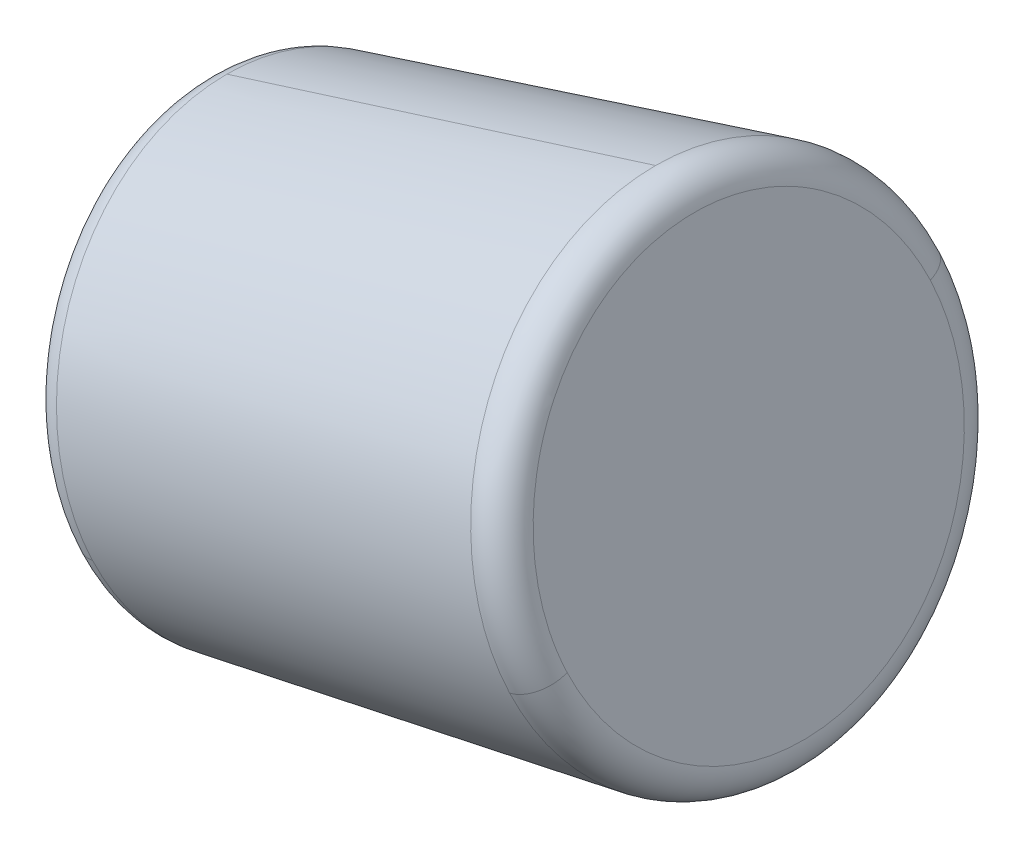
ISO-10303-21;
HEADER;
FILE_DESCRIPTION(('STEP AP214'),'2;1');
FILE_NAME('part.step','',(''),(''),'','','');
FILE_SCHEMA(('AUTOMOTIVE_DESIGN { 1 0 10303 214 1 1 1 1 }'));
ENDSEC;
DATA;
#1=APPLICATION_CONTEXT('core data for automotive mechanical design processes');
#2=APPLICATION_PROTOCOL_DEFINITION('international standard','automotive_design',2000,#1);
#3=PRODUCT_CONTEXT('',#1,'mechanical');
#4=PRODUCT('Part','Part','',(#3));
#5=PRODUCT_RELATED_PRODUCT_CATEGORY('part','',(#4));
#6=PRODUCT_DEFINITION_FORMATION('','',#4);
#7=PRODUCT_DEFINITION_CONTEXT('part definition',#1,'design');
#8=PRODUCT_DEFINITION('design','',#6,#7);
#9=PRODUCT_DEFINITION_SHAPE('','',#8);
#10=(LENGTH_UNIT() NAMED_UNIT(*) SI_UNIT(.MILLI.,.METRE.));
#11=(NAMED_UNIT(*) PLANE_ANGLE_UNIT() SI_UNIT($,.RADIAN.));
#12=(NAMED_UNIT(*) SI_UNIT($,.STERADIAN.) SOLID_ANGLE_UNIT());
#13=UNCERTAINTY_MEASURE_WITH_UNIT(LENGTH_MEASURE(1.E-05),#10,'distance_accuracy_value','');
#14=(GEOMETRIC_REPRESENTATION_CONTEXT(3) GLOBAL_UNCERTAINTY_ASSIGNED_CONTEXT((#13)) GLOBAL_UNIT_ASSIGNED_CONTEXT((#10,
#11,#12)) REPRESENTATION_CONTEXT('',''));
#15=CARTESIAN_POINT('',(0.,0.,0.));
#16=DIRECTION('',(0.,0.,1.));
#17=DIRECTION('',(1.,0.,0.));
#18=AXIS2_PLACEMENT_3D('',#15,#16,#17);
#19=CARTESIAN_POINT('',(32.1924799049898,40.0755787886419,0.));
#20=DIRECTION('',(0.965431699015822,0.260656161514406,0.));
#21=DIRECTION('',(-0.260656161514406,0.965431699015822,0.));
#22=AXIS2_PLACEMENT_3D('',#19,#20,#21);
#23=PLANE('',#22);
#24=CARTESIAN_POINT('',(32.6416984406534,38.4117400687143,5.30412357710646));
#25=CARTESIAN_POINT('',(32.6643205816638,38.3279510191703,5.27592609037514));
#26=CARTESIAN_POINT('',(32.6867619715337,38.2448314449983,5.24559492734474));
#27=CARTESIAN_POINT('',(32.7312299737908,38.080128570831,5.18074627308536));
#28=CARTESIAN_POINT('',(32.7532565861779,37.9985452708357,5.14622878185638));
#29=CARTESIAN_POINT('',(32.7968417582674,37.837112268455,5.07308849559944));
#30=CARTESIAN_POINT('',(32.8184003179699,37.7572625660694,5.03446570057148));
#31=CARTESIAN_POINT('',(32.8609975048126,37.5994889142674,4.95320842348219));
#32=CARTESIAN_POINT('',(32.8820361319528,37.5215649648509,4.91057394142086));
#33=CARTESIAN_POINT('',(32.9235427546146,37.36783060076,4.82139584744887));
#34=CARTESIAN_POINT('',(32.9440107501362,37.2920201860855,4.77485223553821));
#35=CARTESIAN_POINT('',(32.9843268044291,37.1426955103615,4.67796805050633));
#36=CARTESIAN_POINT('',(33.0041748632004,37.0691812493119,4.6276274773851));
#37=CARTESIAN_POINT('',(33.0432032271921,36.9246259871633,4.52327063379589));
#38=CARTESIAN_POINT('',(33.0623835324126,36.8535849860642,4.4692543633279));
#39=CARTESIAN_POINT('',(33.100030182559,36.7141473867304,4.35767625791571));
#40=CARTESIAN_POINT('',(33.118496527485,36.6457507884957,4.3001144229715));
#41=CARTESIAN_POINT('',(33.154670769922,36.511766768576,4.18158385932032));
#42=CARTESIAN_POINT('',(33.172378667433,36.446179346891,4.12061513061334));
#43=CARTESIAN_POINT('',(33.2069933551848,36.3179716858369,3.99541765865564));
#44=CARTESIAN_POINT('',(33.2239001454256,36.2553514464677,3.93118891540492));
#45=CARTESIAN_POINT('',(33.2568718886928,36.1332290077075,3.79962614697136));
#46=CARTESIAN_POINT('',(33.2729368417193,36.0737268083165,3.73229212178852));
#47=CARTESIAN_POINT('',(33.3041862086803,35.9579837955171,3.59468100307035));
#48=CARTESIAN_POINT('',(33.319370622615,35.9017429821088,3.52440390953501));
#49=CARTESIAN_POINT('',(33.3488223308088,35.7926582303219,3.38107595778163));
#50=CARTESIAN_POINT('',(33.3630896250681,35.7398142919433,3.30802509956359));
#51=CARTESIAN_POINT('',(33.3906727227498,35.6376505958917,3.15932560436185));
#52=CARTESIAN_POINT('',(33.4039885261722,35.5883308382186,3.08367696737815));
#53=CARTESIAN_POINT('',(33.4296365632434,35.4933343191943,2.92996415883732));
#54=CARTESIAN_POINT('',(33.4419687968923,35.447657557843,2.85189998728019));
#55=CARTESIAN_POINT('',(33.4656199849853,35.360057070781,2.69354417301949));
#56=CARTESIAN_POINT('',(33.4769389394294,35.3181333450704,2.61325253031592));
#57=CARTESIAN_POINT('',(33.4985363007605,35.238139927217,2.45063520336229));
#58=CARTESIAN_POINT('',(33.5088147076473,35.2000702350743,2.36830951911223));
#59=CARTESIAN_POINT('',(33.5283062122812,35.1278765975798,2.20182243884988));
#60=CARTESIAN_POINT('',(33.5375193100283,35.0937526522279,2.11766104283758));
#61=CARTESIAN_POINT('',(33.5548580012232,35.0295327158883,1.94770529122541));
#62=CARTESIAN_POINT('',(33.562983594671,34.9994367249006,1.86191093562554));
#63=CARTESIAN_POINT('',(33.578127702001,34.9433452011676,1.68889595095555));
#64=CARTESIAN_POINT('',(33.5851462158833,34.9173496684223,1.60167532188544));
#65=CARTESIAN_POINT('',(33.5980592558675,34.8695216866896,1.42601791241003));
#66=CARTESIAN_POINT('',(33.6039537819695,34.8476892377022,1.33758113200473));
#67=CARTESIAN_POINT('',(33.6146046459635,34.808240019767,1.15970447180909));
#68=CARTESIAN_POINT('',(33.6193609838555,34.7906232508193,1.07026459201875));
#69=CARTESIAN_POINT('',(33.6277240129951,34.759647833303,0.890597201557448));
#70=CARTESIAN_POINT('',(33.6313307042426,34.7462891847345,0.800369690886488));
#71=CARTESIAN_POINT('',(33.6373857512579,34.723862190131,0.619344404640153));
#72=CARTESIAN_POINT('',(33.6398341070257,34.7147938440961,0.528546629064777));
#73=CARTESIAN_POINT('',(33.6435665847783,34.7009693009998,0.346599552803916));
#74=CARTESIAN_POINT('',(33.644850706763,34.6962131039384,0.25545025211843));
#75=CARTESIAN_POINT('',(33.6462516233869,34.6910243168845,0.0730197122864389));
#76=CARTESIAN_POINT('',(33.6463684180261,34.690591726892,-0.0182615268600669));
#77=CARTESIAN_POINT('',(33.6454343985905,34.694051196123,-0.200736039113706));
#78=CARTESIAN_POINT('',(33.6443835845157,34.6979432553465,-0.291929312220839));
#79=CARTESIAN_POINT('',(33.6411168791552,34.710042646698,-0.474008199813227));
#80=CARTESIAN_POINT('',(33.6389009878695,34.7182499788259,-0.564893814298483));
#81=CARTESIAN_POINT('',(33.6333094663636,34.7389601438043,-0.746138433241184));
#82=CARTESIAN_POINT('',(33.6299338361432,34.7514629766548,-0.836497437698629));
#83=CARTESIAN_POINT('',(33.6220309689568,34.7807340226587,-1.01647115382945));
#84=CARTESIAN_POINT('',(33.6175037319907,34.7975022358122,-1.10608586550283));
#85=CARTESIAN_POINT('',(33.6073085578231,34.835263646328,-1.28435510637579));
#86=CARTESIAN_POINT('',(33.6016406206215,34.8562568436903,-1.37300963557536));
#87=CARTESIAN_POINT('',(33.5891777005403,34.9024176481725,-1.54914493497465));
#88=CARTESIAN_POINT('',(33.5823827176606,34.9275852552924,-1.63662570517435));
#89=CARTESIAN_POINT('',(33.5676820759318,34.9820342483198,-1.81020273773608));
#90=CARTESIAN_POINT('',(33.5597764170827,35.0113156342273,-1.8962990000981));
#91=CARTESIAN_POINT('',(33.54287346884,35.0739216434065,-2.06689960354727));
#92=CARTESIAN_POINT('',(33.5338761794462,35.1072462666783,-2.15140394463443));
#93=CARTESIAN_POINT('',(33.5148116453723,35.1778584686496,-2.31861712717449));
#94=CARTESIAN_POINT('',(33.5047444006921,35.2151460473491,-2.4013259686274));
#95=CARTESIAN_POINT('',(33.4835642089195,35.2935943311331,-2.56474889905548));
#96=CARTESIAN_POINT('',(33.4724512618271,35.3347550362174,-2.64546298803064));
#97=CARTESIAN_POINT('',(33.4492064372929,35.4208504130271,-2.80470196619317));
#98=CARTESIAN_POINT('',(33.4370745598512,35.4657850847524,-2.88322685538053));
#99=CARTESIAN_POINT('',(33.4118211013738,35.5593201432841,-3.03789826063142));
#100=CARTESIAN_POINT('',(33.3986995203381,35.6079205300904,-3.11404477669495));
#101=CARTESIAN_POINT('',(33.3714982657108,35.7086699361952,-3.26377599207135));
#102=CARTESIAN_POINT('',(33.3574185921193,35.7608189554938,-3.33736069138421));
#103=CARTESIAN_POINT('',(33.3283350715471,35.8685399950279,-3.48179100127336));
#104=CARTESIAN_POINT('',(33.3133312245666,35.9241120152636,-3.55263661184965));
#105=CARTESIAN_POINT('',(33.282435502798,36.0385451788076,-3.69141807098443));
#106=CARTESIAN_POINT('',(33.26654362801,36.097406322116,-3.75935391954293));
#107=CARTESIAN_POINT('',(33.2339101355449,36.2182759301557,-3.89215219123247));
#108=CARTESIAN_POINT('',(33.2171685178679,36.280284394887,-3.95701461436352));
#109=CARTESIAN_POINT('',(33.182875871648,36.4072992619497,-4.08350977593956));
#110=CARTESIAN_POINT('',(33.1653248431051,36.4723056642811,-4.14514251438456));
#111=CARTESIAN_POINT('',(33.1294556571188,36.6051598004268,-4.2650298279232));
#112=CARTESIAN_POINT('',(33.1111374996754,36.6730075342412,-4.32328440301684));
#113=CARTESIAN_POINT('',(33.0737781859335,36.8113808822194,-4.43627504947888));
#114=CARTESIAN_POINT('',(33.0547370296351,36.8819064963833,-4.49101112084727));
#115=CARTESIAN_POINT('',(33.0159775899967,37.0254657026785,-4.59683289586856));
#116=CARTESIAN_POINT('',(32.9962593066567,37.09849929481,-4.64791859952146));
#117=CARTESIAN_POINT('',(32.9561931160068,37.2468985127201,-4.74631656917708));
#118=CARTESIAN_POINT('',(32.935845208697,37.3222641384987,-4.79362883517981));
#119=CARTESIAN_POINT('',(32.8945687899983,37.4751458613095,-4.88436595014223));
#120=CARTESIAN_POINT('',(32.8736402786095,37.5526619583416,-4.92779079910192));
#121=CARTESIAN_POINT('',(32.83125307037,37.7096578805918,-5.01064846571356));
#122=CARTESIAN_POINT('',(32.8097943735193,37.78913770581,-5.05008128336549));
#123=CARTESIAN_POINT('',(32.7663984902364,37.9498696105719,-5.12485989025001));
#124=CARTESIAN_POINT('',(32.7444613038042,38.0311216901155,-5.16020567948259));
#125=CARTESIAN_POINT('',(32.7001612899616,38.195202360152,-5.22672507842611));
#126=CARTESIAN_POINT('',(32.6777984625514,38.2780309506447,-5.25789868813706));
#127=CARTESIAN_POINT('',(32.6327010407628,38.4450651012499,-5.31599862808135));
#128=CARTESIAN_POINT('',(32.6099664463845,38.5292706613623,-5.34292495831469));
#129=CARTESIAN_POINT('',(32.5641802602891,38.6988558926368,-5.39246547141464));
#130=CARTESIAN_POINT('',(32.541128668572,38.7842355637988,-5.41507965428125));
#131=CARTESIAN_POINT('',(32.4947640211023,38.9559633300672,-5.45594139310464));
#132=CARTESIAN_POINT('',(32.4714509653497,39.0423114251736,-5.47418894906142));
#133=CARTESIAN_POINT('',(32.4246195530032,39.2157680192026,-5.50627347408889));
#134=CARTESIAN_POINT('',(32.4011011964094,39.302876518125,-5.52011044315957));
#135=CARTESIAN_POINT('',(32.3539158401575,39.4776440677976,-5.54334046000286));
#136=CARTESIAN_POINT('',(32.3302488404994,39.5653031185478,-5.55273350777546));
#137=CARTESIAN_POINT('',(32.2828232140095,39.7409605934872,-5.56705305312954));
#138=CARTESIAN_POINT('',(32.2590645871777,39.8289590176765,-5.57197955071102));
#139=CARTESIAN_POINT('',(32.2115129428959,40.0050832437961,-5.57735412813305));
#140=CARTESIAN_POINT('',(32.1877199254458,40.0932090457264,-5.57780220797359));
#141=CARTESIAN_POINT('',(32.1401568196055,40.2693757237557,-5.57421886741092));
#142=CARTESIAN_POINT('',(32.1163867312153,40.3574165998547,-5.57018744700771));
#143=CARTESIAN_POINT('',(32.0689267469171,40.533201331012,-5.55765482934497));
#144=CARTESIAN_POINT('',(32.045236851009,40.6209451860703,-5.54915363208544));
#145=CARTESIAN_POINT('',(31.9979943257047,40.7959244814201,-5.52770189850779));
#146=CARTESIAN_POINT('',(31.9744416963084,40.8831599217115,-5.51475136218966));
#147=CARTESIAN_POINT('',(31.9275304331962,41.0569122711141,-5.48443230745298));
#148=CARTESIAN_POINT('',(31.9041717994803,41.1434291802252,-5.46706378903442));
#149=CARTESIAN_POINT('',(31.8577048424421,41.3155358859363,-5.42795002278275));
#150=CARTESIAN_POINT('',(31.8345965191197,41.4011256825362,-5.40620477494963));
#151=CARTESIAN_POINT('',(31.788685697148,41.5711725465805,-5.3583921364789));
#152=CARTESIAN_POINT('',(31.7658831984987,41.6556296140249,-5.33232474584128));
#153=CARTESIAN_POINT('',(31.7432613693257,41.7394175085694,-5.30412357710646));
#154=B_SPLINE_CURVE_WITH_KNOTS('',3,(#24,#25,#26,#27,#28,#29,#30,#31,#32,#33,#34,#35,#36,#37,
#38,#39,#40,#41,#42,#43,#44,#45,#46,#47,#48,#49,#50,#51,#52,#53,#54,#55,#56,#57,#58,#59,#60,#61,
#62,#63,#64,#65,#66,#67,#68,#69,#70,#71,#72,#73,#74,#75,#76,#77,#78,#79,#80,#81,#82,#83,#84,#85,
#86,#87,#88,#89,#90,#91,#92,#93,#94,#95,#96,#97,#98,#99,#100,#101,#102,#103,#104,#105,#106,#107,
#108,#109,#110,#111,#112,#113,#114,#115,#116,#117,#118,#119,#120,#121,#122,#123,#124,#125,#126,
#127,#128,#129,#130,#131,#132,#133,#134,#135,#136,#137,#138,#139,#140,#141,#142,#143,#144,#145,
#146,#147,#148,#149,#150,#151,#152,#153),.UNSPECIFIED.,.F.,.F.,(4,2,2,2,2,2,2,2,2,2,2,2,2,2,2,2,
2,2,2,2,2,2,2,2,2,2,2,2,2,2,2,2,2,2,2,2,2,2,2,2,2,2,2,2,2,2,2,2,2,2,2,2,2,2,2,2,2,2,2,2,2,2,2,2,
4),(0.,0.273737063127681,0.547474126255354,0.821211189383028,1.0949482525107,1.36868531563837,
1.64242237876605,1.91615944189373,2.1898965050214,2.46363356814907,2.73737063127675,
3.01110769440442,3.2848447575321,3.55858182065977,3.83231888378745,4.10605594691512,
4.3797930100428,4.65353007317047,4.92726713629815,5.20100419942582,5.47474126255349,
5.74847832568117,6.02221538880884,6.29595245193652,6.56968951506419,6.84342657819187,
7.11716364131954,7.39090070444721,7.66463776757489,7.93837483070256,8.21211189383024,
8.48584895695791,8.75958602008558,9.03332308321326,9.30706014634093,9.5807972094686,
9.85453427259628,10.128271335724,10.4020083988516,10.6757454619793,10.949482525107,
11.2232195882347,11.4969566513623,11.77069371449,12.0444307776177,12.3181678407454,
12.591904903873,12.8656419670007,13.1393790301284,13.4131160932561,13.6868531563837,
13.9605902195114,14.2343272826391,14.5080643457667,14.7818014088944,15.0555384720221,
15.3292755351498,15.6030125982774,15.8767496614051,16.1504867245328,16.4242237876605,
16.6979608507881,16.9716979139158,17.2454349770435,17.5191720401712),.UNSPECIFIED.);
#155=CARTESIAN_POINT('',(32.6416984406534,38.4117400687143,5.30412357710646));
#156=VERTEX_POINT('',#155);
#157=CARTESIAN_POINT('',(31.7432613693257,41.7394175085694,-5.30412357710646));
#158=VERTEX_POINT('',#157);
#159=EDGE_CURVE('E11',#156,#158,#154,.T.);
#160=ORIENTED_EDGE('',*,*,#159,.F.);
#161=CARTESIAN_POINT('',(31.7432613693257,41.7394175085694,-5.30412357710646));
#162=CARTESIAN_POINT('',(31.7206392283152,41.8232065581134,-5.27592609037514));
#163=CARTESIAN_POINT('',(31.6981978384453,41.9063261322855,-5.24559492734474));
#164=CARTESIAN_POINT('',(31.6537298361883,42.0710290064527,-5.18074627308536));
#165=CARTESIAN_POINT('',(31.6317032238012,42.152612306448,-5.14622878185638));
#166=CARTESIAN_POINT('',(31.5881180517116,42.3140453088288,-5.07308849559944));
#167=CARTESIAN_POINT('',(31.5665594920092,42.3938950112143,-5.03446570057148));
#168=CARTESIAN_POINT('',(31.5239623051665,42.5516686630163,-4.95320842348219));
#169=CARTESIAN_POINT('',(31.5029236780263,42.6295926124328,-4.91057394142086));
#170=CARTESIAN_POINT('',(31.4614170553645,42.7833269765237,-4.82139584744887));
#171=CARTESIAN_POINT('',(31.4409490598429,42.8591373911982,-4.77485223553821));
#172=CARTESIAN_POINT('',(31.40063300555,43.0084620669222,-4.67796805050633));
#173=CARTESIAN_POINT('',(31.3807849467787,43.0819763279718,-4.6276274773851));
#174=CARTESIAN_POINT('',(31.3417565827869,43.2265315901204,-4.52327063379589));
#175=CARTESIAN_POINT('',(31.3225762775664,43.2975725912195,-4.4692543633279));
#176=CARTESIAN_POINT('',(31.28492962742,43.4370101905533,-4.35767625791571));
#177=CARTESIAN_POINT('',(31.266463282494,43.505406788788,-4.30011442297151));
#178=CARTESIAN_POINT('',(31.230289040057,43.6393908087077,-4.18158385932032));
#179=CARTESIAN_POINT('',(31.212581142546,43.7049782303927,-4.12061513061334));
#180=CARTESIAN_POINT('',(31.1779664547943,43.8331858914469,-3.99541765865564));
#181=CARTESIAN_POINT('',(31.1610596645535,43.895806130816,-3.93118891540492));
#182=CARTESIAN_POINT('',(31.1280879212862,44.0179285695762,-3.79962614697136));
#183=CARTESIAN_POINT('',(31.1120229682598,44.0774307689672,-3.73229212178853));
#184=CARTESIAN_POINT('',(31.0807736012987,44.1931737817666,-3.59468100307035));
#185=CARTESIAN_POINT('',(31.0655891873641,44.2494145951749,-3.52440390953501));
#186=CARTESIAN_POINT('',(31.0361374791702,44.3584993469618,-3.38107595778163));
#187=CARTESIAN_POINT('',(31.021870184911,44.4113432853404,-3.30802509956359));
#188=CARTESIAN_POINT('',(30.9942870872293,44.513506981392,-3.15932560436185));
#189=CARTESIAN_POINT('',(30.9809712838068,44.5628267390651,-3.08367696737815));
#190=CARTESIAN_POINT('',(30.9553232467356,44.6578232580894,-2.92996415883732));
#191=CARTESIAN_POINT('',(30.9429910130868,44.7035000194407,-2.8518999872802));
#192=CARTESIAN_POINT('',(30.9193398249938,44.7911005065027,-2.6935441730195));
#193=CARTESIAN_POINT('',(30.9080208705496,44.8330242322134,-2.61325253031592));
#194=CARTESIAN_POINT('',(30.8864235092186,44.9130176500667,-2.45063520336229));
#195=CARTESIAN_POINT('',(30.8761451023317,44.9510873422094,-2.36830951911223));
#196=CARTESIAN_POINT('',(30.8566535976978,45.023280979704,-2.20182243884988));
#197=CARTESIAN_POINT('',(30.8474404999508,45.0574049250558,-2.11766104283759));
#198=CARTESIAN_POINT('',(30.8301018087559,45.1216248613954,-1.94770529122542));
#199=CARTESIAN_POINT('',(30.8219762153081,45.1517208523831,-1.86191093562555));
#200=CARTESIAN_POINT('',(30.806832107978,45.2078123761162,-1.68889595095556));
#201=CARTESIAN_POINT('',(30.7998135940958,45.2338079088614,-1.60167532188545));
#202=CARTESIAN_POINT('',(30.7869005541115,45.2816358905941,-1.42601791241003));
#203=CARTESIAN_POINT('',(30.7810060280096,45.3034683395815,-1.33758113200473));
#204=CARTESIAN_POINT('',(30.7703551640156,45.3429175575167,-1.15970447180909));
#205=CARTESIAN_POINT('',(30.7655988261235,45.3605343264644,-1.07026459201875));
#206=CARTESIAN_POINT('',(30.757235796984,45.3915097439807,-0.890597201557454));
#207=CARTESIAN_POINT('',(30.7536291057365,45.4048683925492,-0.800369690886494));
#208=CARTESIAN_POINT('',(30.7475740587211,45.4272953871527,-0.619344404640158));
#209=CARTESIAN_POINT('',(30.7451257029533,45.4363637331876,-0.528546629064783));
#210=CARTESIAN_POINT('',(30.7413932252008,45.4501882762839,-0.346599552803922));
#211=CARTESIAN_POINT('',(30.7401091032161,45.4549444733453,-0.255450252118436));
#212=CARTESIAN_POINT('',(30.7387081865922,45.4601332603992,-0.0730197122864435));
#213=CARTESIAN_POINT('',(30.738591391953,45.4605658503917,0.0182615268600631));
#214=CARTESIAN_POINT('',(30.7395254113886,45.4571063811607,0.200736039113702));
#215=CARTESIAN_POINT('',(30.7405762254634,45.4532143219372,0.291929312220834));
#216=CARTESIAN_POINT('',(30.7438429308238,45.4411149305858,0.474008199813222));
#217=CARTESIAN_POINT('',(30.7460588221095,45.4329075984578,0.564893814298478));
#218=CARTESIAN_POINT('',(30.7516503436155,45.4121974334794,0.746138433241177));
#219=CARTESIAN_POINT('',(30.7550259738358,45.3996946006289,0.83649743769862));
#220=CARTESIAN_POINT('',(30.7629288410222,45.370423554625,1.01647115382945));
#221=CARTESIAN_POINT('',(30.7674560779884,45.3536553414715,1.10608586550283));
#222=CARTESIAN_POINT('',(30.777651252156,45.3158939309557,1.28435510637579));
#223=CARTESIAN_POINT('',(30.7833191893575,45.2949007335934,1.37300963557536));
#224=CARTESIAN_POINT('',(30.7957821094388,45.2487399291112,1.54914493497464));
#225=CARTESIAN_POINT('',(30.8025770923185,45.2235723219913,1.63662570517435));
#226=CARTESIAN_POINT('',(30.8172777340473,45.1691233289639,1.81020273773607));
#227=CARTESIAN_POINT('',(30.8251833928963,45.1398419430564,1.89629900009809));
#228=CARTESIAN_POINT('',(30.8420863411391,45.0772359338772,2.06689960354726));
#229=CARTESIAN_POINT('',(30.8510836305328,45.0439113106055,2.15140394463442));
#230=CARTESIAN_POINT('',(30.8701481646067,44.9732991086342,2.31861712717449));
#231=CARTESIAN_POINT('',(30.8802154092869,44.9360115299346,2.4013259686274));
#232=CARTESIAN_POINT('',(30.9013956010595,44.8575632461506,2.56474889905547));
#233=CARTESIAN_POINT('',(30.912508548152,44.8164025410663,2.64546298803064));
#234=CARTESIAN_POINT('',(30.9357533726861,44.7303071642566,2.80470196619316));
#235=CARTESIAN_POINT('',(30.9478852501279,44.6853724925313,2.88322685538052));
#236=CARTESIAN_POINT('',(30.9731387086053,44.5918374339997,3.03789826063141));
#237=CARTESIAN_POINT('',(30.986260289641,44.5432370471934,3.11404477669494));
#238=CARTESIAN_POINT('',(31.0134615442682,44.4424876410885,3.26377599207134));
#239=CARTESIAN_POINT('',(31.0275412178598,44.3903386217899,3.3373606913842));
#240=CARTESIAN_POINT('',(31.0566247384319,44.2826175822558,3.48179100127336));
#241=CARTESIAN_POINT('',(31.0716285854125,44.2270455620202,3.55263661184965));
#242=CARTESIAN_POINT('',(31.102524307181,44.1126123984762,3.69141807098443));
#243=CARTESIAN_POINT('',(31.118416181969,44.0537512551678,3.75935391954292));
#244=CARTESIAN_POINT('',(31.1510496744341,43.932881647128,3.89215219123247));
#245=CARTESIAN_POINT('',(31.1677912921112,43.8708731823967,3.95701461436351));
#246=CARTESIAN_POINT('',(31.2020839383311,43.743858315334,4.08350977593956));
#247=CARTESIAN_POINT('',(31.2196349668739,43.6788519130026,4.14514251438455));
#248=CARTESIAN_POINT('',(31.2555041528602,43.5459977768569,4.26502982792319));
#249=CARTESIAN_POINT('',(31.2738223103037,43.4781500430425,4.32328440301684));
#250=CARTESIAN_POINT('',(31.3111816240456,43.3397766950643,4.43627504947887));
#251=CARTESIAN_POINT('',(31.330222780344,43.2692510809005,4.49101112084726));
#252=CARTESIAN_POINT('',(31.3689822199824,43.1256918746052,4.59683289586855));
#253=CARTESIAN_POINT('',(31.3887005033223,43.0526582824737,4.64791859952145));
#254=CARTESIAN_POINT('',(31.4287666939722,42.9042590645636,4.74631656917708));
#255=CARTESIAN_POINT('',(31.4491146012821,42.828893438785,4.79362883517981));
#256=CARTESIAN_POINT('',(31.4903910199808,42.6760117159743,4.88436595014223));
#257=CARTESIAN_POINT('',(31.5113195313696,42.5984956189422,4.92779079910192));
#258=CARTESIAN_POINT('',(31.553706739609,42.4414996966919,5.01064846571355));
#259=CARTESIAN_POINT('',(31.5751654364597,42.3620198714737,5.05008128336549));
#260=CARTESIAN_POINT('',(31.6185613197426,42.2012879667119,5.12485989025001));
#261=CARTESIAN_POINT('',(31.6404985061749,42.1200358871682,5.16020567948258));
#262=CARTESIAN_POINT('',(31.6847985200174,41.9559552171317,5.22672507842611));
#263=CARTESIAN_POINT('',(31.7071613474277,41.873126626639,5.25789868813706));
#264=CARTESIAN_POINT('',(31.7522587692162,41.7060924760338,5.31599862808135));
#265=CARTESIAN_POINT('',(31.7749933635945,41.6218869159214,5.34292495831469));
#266=CARTESIAN_POINT('',(31.8207795496899,41.452301684647,5.39246547141464));
#267=CARTESIAN_POINT('',(31.843831141407,41.366922013485,5.41507965428124));
#268=CARTESIAN_POINT('',(31.8901957888767,41.1951942472165,5.45594139310463));
#269=CARTESIAN_POINT('',(31.9135088446294,41.1088461521101,5.47418894906141));
#270=CARTESIAN_POINT('',(31.9603402569758,40.9353895580812,5.50627347408888));
#271=CARTESIAN_POINT('',(31.9838586135696,40.8482810591587,5.52011044315957));
#272=CARTESIAN_POINT('',(32.0310439698215,40.6735135094861,5.54334046000286));
#273=CARTESIAN_POINT('',(32.0547109694796,40.5858544587359,5.55273350777546));
#274=CARTESIAN_POINT('',(32.1021365959695,40.4101969837965,5.56705305312954));
#275=CARTESIAN_POINT('',(32.1258952228013,40.3221985596072,5.57197955071102));
#276=CARTESIAN_POINT('',(32.1734468670832,40.1460743334876,5.57735412813305));
#277=CARTESIAN_POINT('',(32.1972398845332,40.0579485315573,5.57780220797359));
#278=CARTESIAN_POINT('',(32.2448029903735,39.881781853528,5.57421886741092));
#279=CARTESIAN_POINT('',(32.2685730787637,39.793740977429,5.57018744700771));
#280=CARTESIAN_POINT('',(32.316033063062,39.6179562462717,5.55765482934497));
#281=CARTESIAN_POINT('',(32.33972295897,39.5302123912134,5.54915363208544));
#282=CARTESIAN_POINT('',(32.3869654842743,39.3552330958636,5.52770189850779));
#283=CARTESIAN_POINT('',(32.4105181136707,39.2679976555722,5.51475136218966));
#284=CARTESIAN_POINT('',(32.4574293767828,39.0942453061696,5.48443230745298));
#285=CARTESIAN_POINT('',(32.4807880104987,39.0077283970585,5.46706378903442));
#286=CARTESIAN_POINT('',(32.527254967537,38.8356216913474,5.42795002278275));
#287=CARTESIAN_POINT('',(32.5503632908593,38.7500318947476,5.40620477494963));
#288=CARTESIAN_POINT('',(32.596274112831,38.5799850307033,5.3583921364789));
#289=CARTESIAN_POINT('',(32.6190766114804,38.4955279632589,5.33232474584129));
#290=CARTESIAN_POINT('',(32.6416984406534,38.4117400687143,5.30412357710646));
#291=B_SPLINE_CURVE_WITH_KNOTS('',3,(#161,#162,#163,#164,#165,#166,#167,#168,#169,#170,#171,
#172,#173,#174,#175,#176,#177,#178,#179,#180,#181,#182,#183,#184,#185,#186,#187,#188,#189,#190,
#191,#192,#193,#194,#195,#196,#197,#198,#199,#200,#201,#202,#203,#204,#205,#206,#207,#208,#209,
#210,#211,#212,#213,#214,#215,#216,#217,#218,#219,#220,#221,#222,#223,#224,#225,#226,#227,#228,
#229,#230,#231,#232,#233,#234,#235,#236,#237,#238,#239,#240,#241,#242,#243,#244,#245,#246,#247,
#248,#249,#250,#251,#252,#253,#254,#255,#256,#257,#258,#259,#260,#261,#262,#263,#264,#265,#266,
#267,#268,#269,#270,#271,#272,#273,#274,#275,#276,#277,#278,#279,#280,#281,#282,#283,#284,#285,
#286,#287,#288,#289,#290),.UNSPECIFIED.,.F.,.F.,(4,2,2,2,2,2,2,2,2,2,2,2,2,2,2,2,2,2,2,2,2,2,2,
2,2,2,2,2,2,2,2,2,2,2,2,2,2,2,2,2,2,2,2,2,2,2,2,2,2,2,2,2,2,2,2,2,2,2,2,2,2,2,2,2,4),(0.,
0.273737063127675,0.547474126255348,0.821211189383027,1.0949482525107,1.36868531563837,
1.64242237876605,1.91615944189372,2.1898965050214,2.46363356814907,2.73737063127675,
3.01110769440442,3.28484475753209,3.55858182065977,3.83231888378744,4.10605594691511,
4.37979301004279,4.65353007317047,4.92726713629814,5.20100419942582,5.47474126255349,
5.74847832568116,6.02221538880884,6.29595245193651,6.56968951506419,6.84342657819186,
7.11716364131954,7.39090070444721,7.66463776757488,7.93837483070256,8.21211189383023,
8.48584895695791,8.75958602008558,9.03332308321326,9.30706014634093,9.58079720946861,
9.85453427259628,10.128271335724,10.4020083988516,10.6757454619793,10.949482525107,
11.2232195882347,11.4969566513623,11.77069371449,12.0444307776177,12.3181678407454,
12.591904903873,12.8656419670007,13.1393790301284,13.413116093256,13.6868531563837,
13.9605902195114,14.2343272826391,14.5080643457667,14.7818014088944,15.0555384720221,
15.3292755351498,15.6030125982774,15.8767496614051,16.1504867245328,16.4242237876605,
16.6979608507881,16.9716979139158,17.2454349770435,17.5191720401712),.UNSPECIFIED.);
#292=EDGE_CURVE('E26',#158,#156,#291,.T.);
#293=ORIENTED_EDGE('',*,*,#292,.F.);
#294=EDGE_LOOP('',(#160,#293));
#295=FACE_BOUND('',#294,.T.);
#296=ADVANCED_FACE('F17',(#295),#23,.F.);
#297=CARTESIAN_POINT('',(33.0620120552377,40.3103431047795,0.));
#298=DIRECTION('',(0.965431699015821,0.260656161514406,0.));
#299=DIRECTION('',(0.247898740920758,-0.918180108386898,-0.309016994374947));
#300=AXIS2_PLACEMENT_3D('',#297,#298,#299);
#301=TOROIDAL_SURFACE('',#300,5.57708557401899,0.900666666667962);
#302=CARTESIAN_POINT('',(32.6127935195738,41.9741818247071,-5.30412357710646));
#303=DIRECTION('',(-0.247898740920758,0.918180108386899,0.309016994374945));
#304=DIRECTION('',(-0.120884808758269,0.287163587616323,-0.950223098518868));
#305=AXIS2_PLACEMENT_3D('',#302,#303,#304);
#306=CIRCLE('',#305,0.900666666667961);
#307=CARTESIAN_POINT('',(32.5039166018187,42.2328204959539,-6.15995784784035));
#308=VERTEX_POINT('',#307);
#309=EDGE_CURVE('E139',#308,#158,#306,.T.);
#310=ORIENTED_EDGE('',*,*,#309,.T.);
#311=ORIENTED_EDGE('',*,*,#292,.T.);
#312=CARTESIAN_POINT('',(33.5112305909016,38.646504384852,5.30412357710646));
#313=DIRECTION('',(0.247898740920758,-0.918180108386897,-0.309016994374951));
#314=DIRECTION('',(0.0400683902633328,-0.308983150257276,0.950223098518866));
#315=AXIS2_PLACEMENT_3D('',#312,#313,#314);
#316=CIRCLE('',#315,0.900666666667964);
#317=CARTESIAN_POINT('',(33.5473188543988,38.3682135608532,6.15995784784035));
#318=VERTEX_POINT('',#317);
#319=EDGE_CURVE('E135',#318,#156,#316,.T.);
#320=ORIENTED_EDGE('',*,*,#319,.F.);
#321=CARTESIAN_POINT('',(33.0256177281087,40.3005170284036,0.));
#322=DIRECTION('',(0.965431699015822,0.260656161514406,0.));
#323=DIRECTION('',(-0.260656161514406,0.965431699015822,0.));
#324=AXIS2_PLACEMENT_3D('',#321,#322,#323);
#325=CIRCLE('',#324,6.47696297990418);
#326=CARTESIAN_POINT('',(31.337357419496,46.553582402555,0.));
#327=VERTEX_POINT('',#326);
#328=EDGE_CURVE('E130',#327,#318,#325,.T.);
#329=ORIENTED_EDGE('',*,*,#328,.F.);
#330=CARTESIAN_POINT('',(33.0256177281087,40.3005170284036,0.));
#331=DIRECTION('',(0.965431699015822,0.260656161514406,0.));
#332=DIRECTION('',(-0.260656161514406,0.965431699015822,0.));
#333=AXIS2_PLACEMENT_3D('',#330,#331,#332);
#334=CIRCLE('',#333,6.47696297990418);
#335=EDGE_CURVE('E125',#308,#327,#334,.T.);
#336=ORIENTED_EDGE('',*,*,#335,.F.);
#337=EDGE_LOOP('',(#310,#311,#320,#329,#336));
#338=FACE_BOUND('',#337,.T.);
#339=ADVANCED_FACE('F146',(#338),#301,.T.);
#340=CARTESIAN_POINT('',(33.0256177281087,40.3005170284036,0.));
#341=DIRECTION('',(0.965431699015822,0.260656161514406,0.));
#342=DIRECTION('',(0.,0.,1.));
#343=AXIS2_PLACEMENT_3D('',#340,#341,#342);
#344=CONICAL_SURFACE('',#343,6.47696297990419,0.041867298083281);
#345=DIRECTION('',(0.975495465482102,0.220019537368521,0.));
#346=VECTOR('',#345,1.);
#347=CARTESIAN_POINT('',(34.7138780367215,34.0474516542521,0.));
#348=LINE('',#347,#346);
#349=CARTESIAN_POINT('',(34.7138780367215,34.0474516542521,0.));
#350=VERTEX_POINT('',#349);
#351=CARTESIAN_POINT('',(47.6004100826808,36.9539631854311,0.));
#352=VERTEX_POINT('',#351);
#353=EDGE_CURVE('E92',#350,#352,#348,.T.);
#354=ORIENTED_EDGE('',*,*,#353,.F.);
#355=CARTESIAN_POINT('',(33.0256177281087,40.3005170284036,0.));
#356=DIRECTION('',(0.965431699015822,0.260656161514406,0.));
#357=DIRECTION('',(-0.260656161514406,0.965431699015822,0.));
#358=AXIS2_PLACEMENT_3D('',#355,#356,#357);
#359=CIRCLE('',#358,6.47696297990418);
#360=EDGE_CURVE('E117',#350,#308,#359,.T.);
#361=ORIENTED_EDGE('',*,*,#360,.T.);
#362=ORIENTED_EDGE('',*,*,#335,.T.);
#363=DIRECTION('',(0.953675902841686,0.30083595586149,0.));
#364=VECTOR('',#363,1.);
#365=CARTESIAN_POINT('',(31.337357419496,46.553582402555,0.));
#366=LINE('',#365,#364);
#367=CARTESIAN_POINT('',(43.935647743024,50.527698452259,0.));
#368=VERTEX_POINT('',#367);
#369=EDGE_CURVE('E113',#327,#368,#366,.T.);
#370=ORIENTED_EDGE('',*,*,#369,.T.);
#371=CARTESIAN_POINT('',(45.7680289128524,43.740830818845,0.));
#372=DIRECTION('',(0.965431699015822,0.260656161514406,0.));
#373=DIRECTION('',(-0.260656161514406,0.965431699015822,0.));
#374=AXIS2_PLACEMENT_3D('',#371,#372,#373);
#375=CIRCLE('',#374,7.02987859248107);
#376=CARTESIAN_POINT('',(45.2017919912028,45.8380882561433,-6.68581184414293));
#377=VERTEX_POINT('',#376);
#378=EDGE_CURVE('E84',#377,#368,#375,.T.);
#379=ORIENTED_EDGE('',*,*,#378,.F.);
#380=CARTESIAN_POINT('',(45.7680289128524,43.740830818845,0.));
#381=DIRECTION('',(0.965431699015822,0.260656161514406,0.));
#382=DIRECTION('',(-0.260656161514406,0.965431699015822,0.));
#383=AXIS2_PLACEMENT_3D('',#380,#381,#382);
#384=CIRCLE('',#383,7.02987859248107);
#385=EDGE_CURVE('E106',#352,#377,#384,.T.);
#386=ORIENTED_EDGE('',*,*,#385,.F.);
#387=EDGE_LOOP('',(#354,#361,#362,#370,#379,#386));
#388=FACE_BOUND('',#387,.T.);
#389=ADVANCED_FACE('F155',(#388),#344,.T.);
#390=CARTESIAN_POINT('',(45.8044232399807,43.7506568952209,0.));
#391=DIRECTION('',(0.965431699015821,0.260656161514406,0.));
#392=DIRECTION('',(-0.247898740920758,0.918180108386898,0.309016994374947));
#393=AXIS2_PLACEMENT_3D('',#390,#391,#392);
#394=TOROIDAL_SURFACE('',#393,6.13000118659754,0.900666666666278);
#395=CARTESIAN_POINT('',(45.3106689089571,45.5794495848968,-5.82997757341062));
#396=DIRECTION('',(-0.247898740920759,0.918180108386898,0.309016994374947));
#397=DIRECTION('',(0.965431699015821,0.260656161514408,0.));
#398=AXIS2_PLACEMENT_3D('',#395,#396,#397);
#399=CIRCLE('',#398,0.900666666666279);
#400=CARTESIAN_POINT('',(46.1802010592037,45.814213901034,-5.82997757341062));
#401=VERTEX_POINT('',#400);
#402=EDGE_CURVE('E102',#401,#377,#399,.T.);
#403=ORIENTED_EDGE('',*,*,#402,.F.);
#404=CARTESIAN_POINT('',(46.6739553902273,43.9854212113581,0.));
#405=DIRECTION('',(0.965431699015822,0.260656161514406,0.));
#406=DIRECTION('',(-0.260656161514406,0.965431699015822,0.));
#407=AXIS2_PLACEMENT_3D('',#404,#405,#406);
#408=CIRCLE('',#407,6.1300011865976);
#409=CARTESIAN_POINT('',(47.1677097212508,42.1566285216822,5.82997757341062));
#410=VERTEX_POINT('',#409);
#411=EDGE_CURVE('E74',#410,#401,#408,.T.);
#412=ORIENTED_EDGE('',*,*,#411,.F.);
#413=CARTESIAN_POINT('',(46.2981775710043,41.921864205545,5.82997757341062));
#414=DIRECTION('',(0.24789874092076,-0.918180108386898,-0.309016994374947));
#415=DIRECTION('',(0.965431699015821,0.260656161514408,0.));
#416=AXIS2_PLACEMENT_3D('',#413,#414,#415);
#417=CIRCLE('',#416,0.900666666666279);
#418=CARTESIAN_POINT('',(46.334265834502,41.6435733815469,6.68581184414293));
#419=VERTEX_POINT('',#418);
#420=EDGE_CURVE('E67',#410,#419,#417,.T.);
#421=ORIENTED_EDGE('',*,*,#420,.T.);
#422=CARTESIAN_POINT('',(45.7680289128524,43.740830818845,0.));
#423=DIRECTION('',(0.965431699015822,0.260656161514406,0.));
#424=DIRECTION('',(-0.260656161514406,0.965431699015822,0.));
#425=AXIS2_PLACEMENT_3D('',#422,#423,#424);
#426=CIRCLE('',#425,7.02987859248107);
#427=EDGE_CURVE('E72',#419,#352,#426,.T.);
#428=ORIENTED_EDGE('',*,*,#427,.T.);
#429=ORIENTED_EDGE('',*,*,#385,.T.);
#430=EDGE_LOOP('',(#403,#412,#421,#428,#429));
#431=FACE_BOUND('',#430,.T.);
#432=ADVANCED_FACE('F69',(#431),#394,.T.);
#433=CARTESIAN_POINT('',(33.0256177281087,40.3005170284036,0.));
#434=DIRECTION('',(0.965431699015822,0.260656161514406,0.));
#435=DIRECTION('',(0.,0.,-1.));
#436=AXIS2_PLACEMENT_3D('',#433,#434,#435);
#437=CONICAL_SURFACE('',#436,6.47696297990419,0.041867298083281);
#438=ORIENTED_EDGE('',*,*,#353,.T.);
#439=ORIENTED_EDGE('',*,*,#427,.F.);
#440=CARTESIAN_POINT('',(45.7680289128524,43.740830818845,0.));
#441=DIRECTION('',(0.965431699015822,0.260656161514406,0.));
#442=DIRECTION('',(-0.260656161514406,0.965431699015822,0.));
#443=AXIS2_PLACEMENT_3D('',#440,#441,#442);
#444=CIRCLE('',#443,7.02987859248107);
#445=EDGE_CURVE('E81',#368,#419,#444,.T.);
#446=ORIENTED_EDGE('',*,*,#445,.F.);
#447=ORIENTED_EDGE('',*,*,#369,.F.);
#448=ORIENTED_EDGE('',*,*,#328,.T.);
#449=CARTESIAN_POINT('',(33.0256177281087,40.3005170284036,0.));
#450=DIRECTION('',(0.965431699015822,0.260656161514406,0.));
#451=DIRECTION('',(-0.260656161514406,0.965431699015822,0.));
#452=AXIS2_PLACEMENT_3D('',#449,#450,#451);
#453=CIRCLE('',#452,6.47696297990418);
#454=EDGE_CURVE('E87',#318,#350,#453,.T.);
#455=ORIENTED_EDGE('',*,*,#454,.T.);
#456=EDGE_LOOP('',(#438,#439,#446,#447,#448,#455));
#457=FACE_BOUND('',#456,.T.);
#458=ADVANCED_FACE('F90',(#457),#437,.T.);
#459=CARTESIAN_POINT('',(33.0620120552377,40.3103431047795,0.));
#460=DIRECTION('',(0.965431699015821,0.260656161514406,0.));
#461=DIRECTION('',(-0.247898740920758,0.918180108386898,0.309016994374947));
#462=AXIS2_PLACEMENT_3D('',#459,#460,#461);
#463=TOROIDAL_SURFACE('',#462,5.57708557401899,0.900666666667962);
#464=ORIENTED_EDGE('',*,*,#309,.F.);
#465=ORIENTED_EDGE('',*,*,#360,.F.);
#466=ORIENTED_EDGE('',*,*,#454,.F.);
#467=ORIENTED_EDGE('',*,*,#319,.T.);
#468=ORIENTED_EDGE('',*,*,#159,.T.);
#469=EDGE_LOOP('',(#464,#465,#466,#467,#468));
#470=FACE_BOUND('',#469,.T.);
#471=ADVANCED_FACE('F164',(#470),#463,.T.);
#472=CARTESIAN_POINT('',(45.8044232399807,43.7506568952209,0.));
#473=DIRECTION('',(0.965431699015821,0.260656161514406,0.));
#474=DIRECTION('',(0.247898740920758,-0.918180108386898,-0.309016994374947));
#475=AXIS2_PLACEMENT_3D('',#472,#473,#474);
#476=TOROIDAL_SURFACE('',#475,6.13000118659754,0.900666666666278);
#477=ORIENTED_EDGE('',*,*,#402,.T.);
#478=ORIENTED_EDGE('',*,*,#378,.T.);
#479=ORIENTED_EDGE('',*,*,#445,.T.);
#480=ORIENTED_EDGE('',*,*,#420,.F.);
#481=CARTESIAN_POINT('',(46.1802010592036,45.814213901034,-5.82997757341067));
#482=CARTESIAN_POINT('',(45.7030107825727,47.5816557940052,-5.2343158756598));
#483=CARTESIAN_POINT('',(45.2854275439871,49.1283220733131,-3.92294043948106));
#484=CARTESIAN_POINT('',(45.0310492581285,50.0705014535449,-2.00270938275402));
#485=CARTESIAN_POINT('',(44.9673213950744,50.306539990848,2.12739647535679));
#486=CARTESIAN_POINT('',(45.6516512086302,47.7718840258795,5.32501460082944));
#487=CARTESIAN_POINT('',(46.1516458725578,45.9199780701945,6.30488565122939));
#488=CARTESIAN_POINT('',(46.6903934399382,43.924537117275,6.4241514776937));
#489=CARTESIAN_POINT('',(47.1677097212508,42.1566285216822,5.82997757341068));
#490=B_SPLINE_CURVE_WITH_KNOTS('',5,(#481,#482,#483,#484,#485,#486,#487,#488,#489),
.UNSPECIFIED.,.F.,.F.,(6,3,6),(0.,1.57079632679489,3.14159265358978),.UNSPECIFIED.);
#491=EDGE_CURVE('E185',#401,#410,#490,.T.);
#492=ORIENTED_EDGE('',*,*,#491,.F.);
#493=EDGE_LOOP('',(#477,#478,#479,#480,#492));
#494=FACE_BOUND('',#493,.T.);
#495=ADVANCED_FACE('F83',(#494),#476,.T.);
#496=CARTESIAN_POINT('',(45.0761328108499,49.903518671904,0.));
#497=DIRECTION('',(-0.965431699015822,-0.260656161514406,0.));
#498=DIRECTION('',(0.260656161514406,-0.965431699015822,0.));
#499=AXIS2_PLACEMENT_3D('',#496,#497,#498);
#500=PLANE('',#499);
#501=ORIENTED_EDGE('',*,*,#491,.T.);
#502=ORIENTED_EDGE('',*,*,#411,.T.);
#503=EDGE_LOOP('',(#501,#502));
#504=FACE_BOUND('',#503,.T.);
#505=ADVANCED_FACE('F191',(#504),#500,.F.);
#506=CLOSED_SHELL('',(#296,#339,#389,#432,#458,#471,#495,#505));
#507=MANIFOLD_SOLID_BREP('B1',#506);
#508=ADVANCED_BREP_SHAPE_REPRESENTATION('',(#18,#507),#14);
#509=SHAPE_DEFINITION_REPRESENTATION(#9,#508);
ENDSEC;
END-ISO-10303-21;
